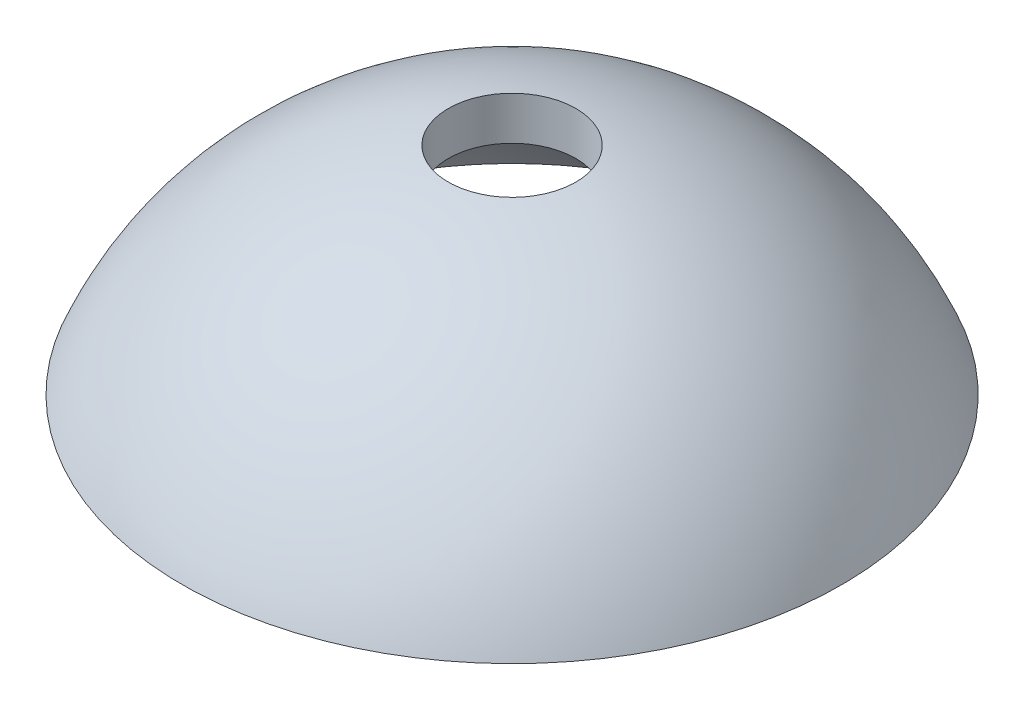
ISO-10303-21;
HEADER;
FILE_DESCRIPTION(('STEP AP214'),'2;1');
FILE_NAME('part.step','',(''),(''),'','','');
FILE_SCHEMA(('AUTOMOTIVE_DESIGN { 1 0 10303 214 1 1 1 1 }'));
ENDSEC;
DATA;
#1=APPLICATION_CONTEXT('core data for automotive mechanical design processes');
#2=APPLICATION_PROTOCOL_DEFINITION('international standard','automotive_design',2000,#1);
#3=PRODUCT_CONTEXT('',#1,'mechanical');
#4=PRODUCT('Part','Part','',(#3));
#5=PRODUCT_RELATED_PRODUCT_CATEGORY('part','',(#4));
#6=PRODUCT_DEFINITION_FORMATION('','',#4);
#7=PRODUCT_DEFINITION_CONTEXT('part definition',#1,'design');
#8=PRODUCT_DEFINITION('design','',#6,#7);
#9=PRODUCT_DEFINITION_SHAPE('','',#8);
#10=(LENGTH_UNIT() NAMED_UNIT(*) SI_UNIT(.MILLI.,.METRE.));
#11=(NAMED_UNIT(*) PLANE_ANGLE_UNIT() SI_UNIT($,.RADIAN.));
#12=(NAMED_UNIT(*) SI_UNIT($,.STERADIAN.) SOLID_ANGLE_UNIT());
#13=UNCERTAINTY_MEASURE_WITH_UNIT(LENGTH_MEASURE(1.E-05),#10,'distance_accuracy_value','');
#14=(GEOMETRIC_REPRESENTATION_CONTEXT(3) GLOBAL_UNCERTAINTY_ASSIGNED_CONTEXT((#13)) GLOBAL_UNIT_ASSIGNED_CONTEXT((#10,
#11,#12)) REPRESENTATION_CONTEXT('',''));
#15=CARTESIAN_POINT('',(0.,0.,0.));
#16=DIRECTION('',(0.,0.,1.));
#17=DIRECTION('',(1.,0.,0.));
#18=AXIS2_PLACEMENT_3D('',#15,#16,#17);
#19=CARTESIAN_POINT('',(0.,0.,0.));
#20=DIRECTION('',(0.,-1.,0.));
#21=DIRECTION('',(0.,0.,-1.));
#22=AXIS2_PLACEMENT_3D('',#19,#20,#21);
#23=SPHERICAL_SURFACE('',#22,16.7351923677621);
#24=CARTESIAN_POINT('',(0.,6.31004465800379,0.));
#25=DIRECTION('',(0.,-1.,0.));
#26=DIRECTION('',(0.,0.,-1.));
#27=AXIS2_PLACEMENT_3D('',#24,#25,#26);
#28=CIRCLE('',#27,15.5);
#29=CARTESIAN_POINT('',(0.,6.31004465800379,-15.5));
#30=VERTEX_POINT('',#29);
#31=EDGE_CURVE('E47',#30,#30,#28,.T.);
#32=ORIENTED_EDGE('',*,*,#31,.F.);
#33=EDGE_LOOP('',(#32));
#34=FACE_BOUND('',#33,.T.);
#35=CARTESIAN_POINT('',(0.,16.4641022708802,0.));
#36=DIRECTION('',(0.,-1.,0.));
#37=DIRECTION('',(0.,0.,-1.));
#38=AXIS2_PLACEMENT_3D('',#35,#36,#37);
#39=CIRCLE('',#38,3.);
#40=CARTESIAN_POINT('',(0.,16.4641022708802,-3.));
#41=VERTEX_POINT('',#40);
#42=EDGE_CURVE('E10',#41,#41,#39,.T.);
#43=ORIENTED_EDGE('',*,*,#42,.T.);
#44=EDGE_LOOP('',(#43));
#45=FACE_BOUND('',#44,.T.);
#46=ADVANCED_FACE('F33',(#34,#45),#23,.T.);
#47=CARTESIAN_POINT('',(0.,0.,0.));
#48=DIRECTION('',(0.,-1.,0.));
#49=DIRECTION('',(0.,0.,-1.));
#50=AXIS2_PLACEMENT_3D('',#47,#48,#49);
#51=CYLINDRICAL_SURFACE('',#50,3.);
#52=CARTESIAN_POINT('',(0.,14.4265690347689,0.));
#53=DIRECTION('',(0.,-1.,0.));
#54=DIRECTION('',(0.,0.,-1.));
#55=AXIS2_PLACEMENT_3D('',#52,#53,#54);
#56=CIRCLE('',#55,3.);
#57=CARTESIAN_POINT('',(0.,14.4265690347689,-3.));
#58=VERTEX_POINT('',#57);
#59=EDGE_CURVE('E39',#58,#58,#56,.T.);
#60=ORIENTED_EDGE('',*,*,#59,.T.);
#61=EDGE_LOOP('',(#60));
#62=FACE_BOUND('',#61,.T.);
#63=ORIENTED_EDGE('',*,*,#42,.F.);
#64=EDGE_LOOP('',(#63));
#65=FACE_BOUND('',#64,.T.);
#66=ADVANCED_FACE('F57',(#62,#65),#51,.F.);
#67=CARTESIAN_POINT('',(0.,0.,0.));
#68=DIRECTION('',(0.,-1.,0.));
#69=DIRECTION('',(0.,0.,-1.));
#70=AXIS2_PLACEMENT_3D('',#67,#68,#69);
#71=SPHERICAL_SURFACE('',#70,14.7351923677621);
#72=CARTESIAN_POINT('',(0.,6.30507337812622,0.));
#73=DIRECTION('',(0.,-1.,0.));
#74=DIRECTION('',(0.,0.,-1.));
#75=AXIS2_PLACEMENT_3D('',#72,#73,#74);
#76=CIRCLE('',#75,13.318105864251);
#77=CARTESIAN_POINT('',(0.,6.30507337812622,-13.318105864251));
#78=VERTEX_POINT('',#77);
#79=EDGE_CURVE('E43',#78,#78,#76,.T.);
#80=ORIENTED_EDGE('',*,*,#79,.T.);
#81=EDGE_LOOP('',(#80));
#82=FACE_BOUND('',#81,.T.);
#83=ORIENTED_EDGE('',*,*,#59,.F.);
#84=EDGE_LOOP('',(#83));
#85=FACE_BOUND('',#84,.T.);
#86=ADVANCED_FACE('F61',(#82,#85),#71,.F.);
#87=CARTESIAN_POINT('',(0.,6.30507337812622,0.));
#88=DIRECTION('',(0.,1.,0.));
#89=DIRECTION('',(0.,0.,1.));
#90=AXIS2_PLACEMENT_3D('',#87,#88,#89);
#91=CONICAL_SURFACE('',#90,13.318105864251,1.56851790677725);
#92=ORIENTED_EDGE('',*,*,#31,.T.);
#93=EDGE_LOOP('',(#92));
#94=FACE_BOUND('',#93,.T.);
#95=ORIENTED_EDGE('',*,*,#79,.F.);
#96=EDGE_LOOP('',(#95));
#97=FACE_BOUND('',#96,.T.);
#98=ADVANCED_FACE('F53',(#94,#97),#91,.T.);
#99=CLOSED_SHELL('',(#46,#66,#86,#98));
#100=MANIFOLD_SOLID_BREP('B2',#99);
#101=ADVANCED_BREP_SHAPE_REPRESENTATION('',(#18,#100),#14);
#102=SHAPE_DEFINITION_REPRESENTATION(#9,#101);
ENDSEC;
END-ISO-10303-21;
